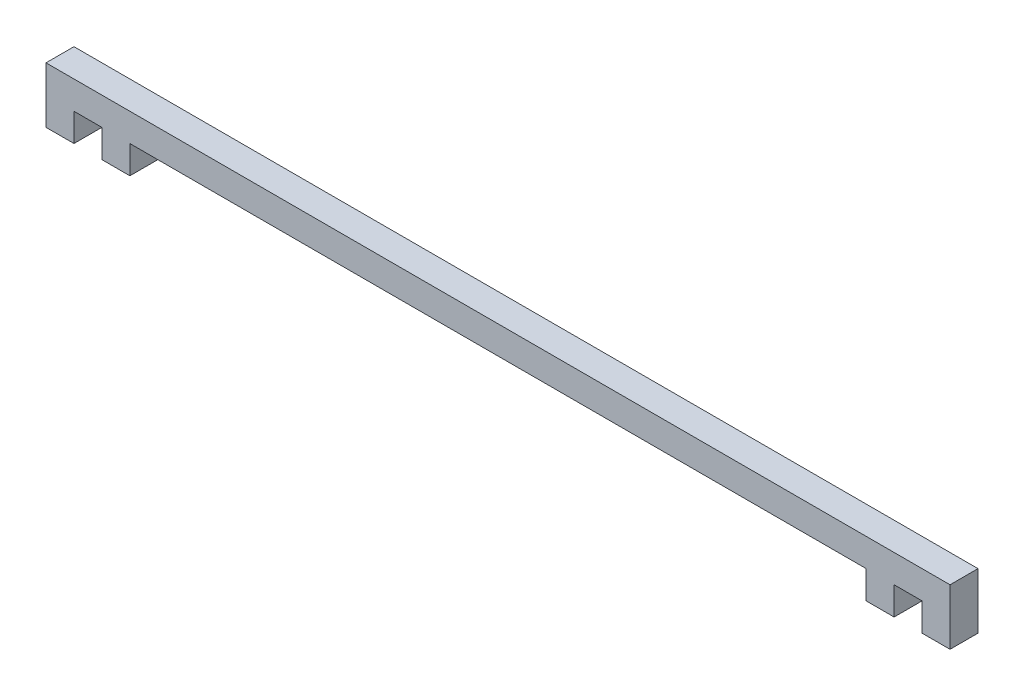
ISO-10303-21;
HEADER;
FILE_DESCRIPTION(('STEP AP214'),'2;1');
FILE_NAME('part.step','',(''),(''),'','','');
FILE_SCHEMA(('AUTOMOTIVE_DESIGN { 1 0 10303 214 1 1 1 1 }'));
ENDSEC;
DATA;
#1=APPLICATION_CONTEXT('core data for automotive mechanical design processes');
#2=APPLICATION_PROTOCOL_DEFINITION('international standard','automotive_design',2000,#1);
#3=PRODUCT_CONTEXT('',#1,'mechanical');
#4=PRODUCT('Part','Part','',(#3));
#5=PRODUCT_RELATED_PRODUCT_CATEGORY('part','',(#4));
#6=PRODUCT_DEFINITION_FORMATION('','',#4);
#7=PRODUCT_DEFINITION_CONTEXT('part definition',#1,'design');
#8=PRODUCT_DEFINITION('design','',#6,#7);
#9=PRODUCT_DEFINITION_SHAPE('','',#8);
#10=(LENGTH_UNIT() NAMED_UNIT(*) SI_UNIT(.MILLI.,.METRE.));
#11=(NAMED_UNIT(*) PLANE_ANGLE_UNIT() SI_UNIT($,.RADIAN.));
#12=(NAMED_UNIT(*) SI_UNIT($,.STERADIAN.) SOLID_ANGLE_UNIT());
#13=UNCERTAINTY_MEASURE_WITH_UNIT(LENGTH_MEASURE(1.E-05),#10,'distance_accuracy_value','');
#14=(GEOMETRIC_REPRESENTATION_CONTEXT(3) GLOBAL_UNCERTAINTY_ASSIGNED_CONTEXT((#13)) GLOBAL_UNIT_ASSIGNED_CONTEXT((#10,
#11,#12)) REPRESENTATION_CONTEXT('',''));
#15=CARTESIAN_POINT('',(0.,0.,0.));
#16=DIRECTION('',(0.,0.,1.));
#17=DIRECTION('',(1.,0.,0.));
#18=AXIS2_PLACEMENT_3D('',#15,#16,#17);
#19=CARTESIAN_POINT('',(35.5878594249201,0.,3.));
#20=DIRECTION('',(1.,0.,0.));
#21=DIRECTION('',(0.,0.,-1.));
#22=AXIS2_PLACEMENT_3D('',#19,#20,#21);
#23=PLANE('',#22);
#24=DIRECTION('',(0.,-1.,0.));
#25=VECTOR('',#24,1.);
#26=CARTESIAN_POINT('',(35.5878594249201,0.,0.));
#27=LINE('',#26,#25);
#28=CARTESIAN_POINT('',(35.5878594249201,0.,0.));
#29=VERTEX_POINT('',#28);
#30=CARTESIAN_POINT('',(35.5878594249201,-3.,0.));
#31=VERTEX_POINT('',#30);
#32=EDGE_CURVE('E188',#29,#31,#27,.T.);
#33=ORIENTED_EDGE('',*,*,#32,.T.);
#34=DIRECTION('',(0.,0.,-1.));
#35=VECTOR('',#34,1.);
#36=CARTESIAN_POINT('',(35.5878594249201,-3.,3.));
#37=LINE('',#36,#35);
#38=CARTESIAN_POINT('',(35.5878594249201,-3.,3.));
#39=VERTEX_POINT('',#38);
#40=EDGE_CURVE('E11',#39,#31,#37,.T.);
#41=ORIENTED_EDGE('',*,*,#40,.F.);
#42=DIRECTION('',(0.,-1.,0.));
#43=VECTOR('',#42,1.);
#44=CARTESIAN_POINT('',(35.5878594249201,0.,3.));
#45=LINE('',#44,#43);
#46=CARTESIAN_POINT('',(35.5878594249201,0.,3.));
#47=VERTEX_POINT('',#46);
#48=EDGE_CURVE('E234',#47,#39,#45,.T.);
#49=ORIENTED_EDGE('',*,*,#48,.F.);
#50=DIRECTION('',(0.,0.,-1.));
#51=VECTOR('',#50,1.);
#52=CARTESIAN_POINT('',(35.5878594249201,0.,3.));
#53=LINE('',#52,#51);
#54=EDGE_CURVE('E184',#47,#29,#53,.T.);
#55=ORIENTED_EDGE('',*,*,#54,.T.);
#56=EDGE_LOOP('',(#33,#41,#49,#55));
#57=FACE_BOUND('',#56,.T.);
#58=ADVANCED_FACE('F39',(#57),#23,.F.);
#59=CARTESIAN_POINT('',(35.5878594249201,-3.,3.));
#60=DIRECTION('',(0.,1.,0.));
#61=DIRECTION('',(0.,0.,1.));
#62=AXIS2_PLACEMENT_3D('',#59,#60,#61);
#63=PLANE('',#62);
#64=DIRECTION('',(1.,0.,0.));
#65=VECTOR('',#64,1.);
#66=CARTESIAN_POINT('',(35.5878594249201,-3.,0.));
#67=LINE('',#66,#65);
#68=CARTESIAN_POINT('',(38.5878594249201,-3.,0.));
#69=VERTEX_POINT('',#68);
#70=EDGE_CURVE('E192',#31,#69,#67,.T.);
#71=ORIENTED_EDGE('',*,*,#70,.T.);
#72=DIRECTION('',(0.,0.,-1.));
#73=VECTOR('',#72,1.);
#74=CARTESIAN_POINT('',(38.5878594249201,-3.,3.));
#75=LINE('',#74,#73);
#76=CARTESIAN_POINT('',(38.5878594249201,-3.,3.));
#77=VERTEX_POINT('',#76);
#78=EDGE_CURVE('E48',#77,#69,#75,.T.);
#79=ORIENTED_EDGE('',*,*,#78,.F.);
#80=DIRECTION('',(1.,0.,0.));
#81=VECTOR('',#80,1.);
#82=CARTESIAN_POINT('',(35.5878594249201,-3.,3.));
#83=LINE('',#82,#81);
#84=EDGE_CURVE('E123',#39,#77,#83,.T.);
#85=ORIENTED_EDGE('',*,*,#84,.F.);
#86=ORIENTED_EDGE('',*,*,#40,.T.);
#87=EDGE_LOOP('',(#71,#79,#85,#86));
#88=FACE_BOUND('',#87,.T.);
#89=ADVANCED_FACE('F356',(#88),#63,.F.);
#90=CARTESIAN_POINT('',(38.5878594249201,-3.,3.));
#91=DIRECTION('',(-1.,0.,0.));
#92=DIRECTION('',(0.,0.,1.));
#93=AXIS2_PLACEMENT_3D('',#90,#91,#92);
#94=PLANE('',#93);
#95=DIRECTION('',(0.,1.,0.));
#96=VECTOR('',#95,1.);
#97=CARTESIAN_POINT('',(38.5878594249201,-3.,0.));
#98=LINE('',#97,#96);
#99=CARTESIAN_POINT('',(38.5878594249201,0.,0.));
#100=VERTEX_POINT('',#99);
#101=EDGE_CURVE('E195',#69,#100,#98,.T.);
#102=ORIENTED_EDGE('',*,*,#101,.T.);
#103=DIRECTION('',(0.,0.,-1.));
#104=VECTOR('',#103,1.);
#105=CARTESIAN_POINT('',(38.5878594249201,0.,3.));
#106=LINE('',#105,#104);
#107=CARTESIAN_POINT('',(38.5878594249201,0.,3.));
#108=VERTEX_POINT('',#107);
#109=EDGE_CURVE('E277',#108,#100,#106,.T.);
#110=ORIENTED_EDGE('',*,*,#109,.F.);
#111=DIRECTION('',(0.,1.,0.));
#112=VECTOR('',#111,1.);
#113=CARTESIAN_POINT('',(38.5878594249201,-3.,3.));
#114=LINE('',#113,#112);
#115=EDGE_CURVE('E287',#77,#108,#114,.T.);
#116=ORIENTED_EDGE('',*,*,#115,.F.);
#117=ORIENTED_EDGE('',*,*,#78,.T.);
#118=EDGE_LOOP('',(#102,#110,#116,#117));
#119=FACE_BOUND('',#118,.T.);
#120=ADVANCED_FACE('F285',(#119),#94,.F.);
#121=CARTESIAN_POINT('',(38.5878594249201,0.,3.));
#122=DIRECTION('',(0.,1.,0.));
#123=DIRECTION('',(0.,0.,1.));
#124=AXIS2_PLACEMENT_3D('',#121,#122,#123);
#125=PLANE('',#124);
#126=DIRECTION('',(1.,0.,0.));
#127=VECTOR('',#126,1.);
#128=CARTESIAN_POINT('',(38.5878594249201,0.,0.));
#129=LINE('',#128,#127);
#130=CARTESIAN_POINT('',(41.5878594249201,0.,0.));
#131=VERTEX_POINT('',#130);
#132=EDGE_CURVE('E198',#100,#131,#129,.T.);
#133=ORIENTED_EDGE('',*,*,#132,.T.);
#134=DIRECTION('',(0.,0.,-1.));
#135=VECTOR('',#134,1.);
#136=CARTESIAN_POINT('',(41.5878594249201,0.,3.));
#137=LINE('',#136,#135);
#138=CARTESIAN_POINT('',(41.5878594249201,0.,3.));
#139=VERTEX_POINT('',#138);
#140=EDGE_CURVE('E273',#139,#131,#137,.T.);
#141=ORIENTED_EDGE('',*,*,#140,.F.);
#142=DIRECTION('',(1.,0.,0.));
#143=VECTOR('',#142,1.);
#144=CARTESIAN_POINT('',(38.5878594249201,0.,3.));
#145=LINE('',#144,#143);
#146=EDGE_CURVE('E306',#108,#139,#145,.T.);
#147=ORIENTED_EDGE('',*,*,#146,.F.);
#148=ORIENTED_EDGE('',*,*,#109,.T.);
#149=EDGE_LOOP('',(#133,#141,#147,#148));
#150=FACE_BOUND('',#149,.T.);
#151=ADVANCED_FACE('F296',(#150),#125,.F.);
#152=CARTESIAN_POINT('',(41.5878594249201,0.,3.));
#153=DIRECTION('',(1.,0.,0.));
#154=DIRECTION('',(0.,0.,-1.));
#155=AXIS2_PLACEMENT_3D('',#152,#153,#154);
#156=PLANE('',#155);
#157=DIRECTION('',(0.,-1.,0.));
#158=VECTOR('',#157,1.);
#159=CARTESIAN_POINT('',(41.5878594249201,0.,0.));
#160=LINE('',#159,#158);
#161=CARTESIAN_POINT('',(41.5878594249201,-3.,0.));
#162=VERTEX_POINT('',#161);
#163=EDGE_CURVE('E201',#131,#162,#160,.T.);
#164=ORIENTED_EDGE('',*,*,#163,.T.);
#165=DIRECTION('',(0.,0.,-1.));
#166=VECTOR('',#165,1.);
#167=CARTESIAN_POINT('',(41.5878594249201,-3.,3.));
#168=LINE('',#167,#166);
#169=CARTESIAN_POINT('',(41.5878594249201,-3.,3.));
#170=VERTEX_POINT('',#169);
#171=EDGE_CURVE('E269',#170,#162,#168,.T.);
#172=ORIENTED_EDGE('',*,*,#171,.F.);
#173=DIRECTION('',(0.,-1.,0.));
#174=VECTOR('',#173,1.);
#175=CARTESIAN_POINT('',(41.5878594249201,0.,3.));
#176=LINE('',#175,#174);
#177=EDGE_CURVE('E302',#139,#170,#176,.T.);
#178=ORIENTED_EDGE('',*,*,#177,.F.);
#179=ORIENTED_EDGE('',*,*,#140,.T.);
#180=EDGE_LOOP('',(#164,#172,#178,#179));
#181=FACE_BOUND('',#180,.T.);
#182=ADVANCED_FACE('F300',(#181),#156,.F.);
#183=CARTESIAN_POINT('',(41.5878594249201,-3.,3.));
#184=DIRECTION('',(0.,1.,0.));
#185=DIRECTION('',(0.,0.,1.));
#186=AXIS2_PLACEMENT_3D('',#183,#184,#185);
#187=PLANE('',#186);
#188=DIRECTION('',(1.,0.,0.));
#189=VECTOR('',#188,1.);
#190=CARTESIAN_POINT('',(41.5878594249201,-3.,0.));
#191=LINE('',#190,#189);
#192=CARTESIAN_POINT('',(44.5878594249201,-3.,0.));
#193=VERTEX_POINT('',#192);
#194=EDGE_CURVE('E204',#162,#193,#191,.T.);
#195=ORIENTED_EDGE('',*,*,#194,.T.);
#196=DIRECTION('',(0.,0.,-1.));
#197=VECTOR('',#196,1.);
#198=CARTESIAN_POINT('',(44.5878594249201,-3.,3.));
#199=LINE('',#198,#197);
#200=CARTESIAN_POINT('',(44.5878594249201,-3.,3.));
#201=VERTEX_POINT('',#200);
#202=EDGE_CURVE('E265',#201,#193,#199,.T.);
#203=ORIENTED_EDGE('',*,*,#202,.F.);
#204=DIRECTION('',(1.,0.,0.));
#205=VECTOR('',#204,1.);
#206=CARTESIAN_POINT('',(41.5878594249201,-3.,3.));
#207=LINE('',#206,#205);
#208=EDGE_CURVE('E305',#170,#201,#207,.T.);
#209=ORIENTED_EDGE('',*,*,#208,.F.);
#210=ORIENTED_EDGE('',*,*,#171,.T.);
#211=EDGE_LOOP('',(#195,#203,#209,#210));
#212=FACE_BOUND('',#211,.T.);
#213=ADVANCED_FACE('F369',(#212),#187,.F.);
#214=CARTESIAN_POINT('',(44.5878594249201,-3.,3.));
#215=DIRECTION('',(-1.,0.,0.));
#216=DIRECTION('',(0.,-1.,0.));
#217=AXIS2_PLACEMENT_3D('',#214,#215,#216);
#218=PLANE('',#217);
#219=DIRECTION('',(0.,1.,0.));
#220=VECTOR('',#219,1.);
#221=CARTESIAN_POINT('',(44.5878594249201,-3.,0.));
#222=LINE('',#221,#220);
#223=CARTESIAN_POINT('',(44.5878594249201,3.,0.));
#224=VERTEX_POINT('',#223);
#225=EDGE_CURVE('E207',#193,#224,#222,.T.);
#226=ORIENTED_EDGE('',*,*,#225,.T.);
#227=DIRECTION('',(0.,0.,-1.));
#228=VECTOR('',#227,1.);
#229=CARTESIAN_POINT('',(44.5878594249201,3.,3.));
#230=LINE('',#229,#228);
#231=CARTESIAN_POINT('',(44.5878594249201,3.,3.));
#232=VERTEX_POINT('',#231);
#233=EDGE_CURVE('E261',#232,#224,#230,.T.);
#234=ORIENTED_EDGE('',*,*,#233,.F.);
#235=DIRECTION('',(0.,1.,0.));
#236=VECTOR('',#235,1.);
#237=CARTESIAN_POINT('',(44.5878594249201,-3.,3.));
#238=LINE('',#237,#236);
#239=EDGE_CURVE('E310',#201,#232,#238,.T.);
#240=ORIENTED_EDGE('',*,*,#239,.F.);
#241=ORIENTED_EDGE('',*,*,#202,.T.);
#242=EDGE_LOOP('',(#226,#234,#240,#241));
#243=FACE_BOUND('',#242,.T.);
#244=ADVANCED_FACE('F372',(#243),#218,.F.);
#245=CARTESIAN_POINT('',(44.5878594249201,3.,3.));
#246=DIRECTION('',(0.,-1.,0.));
#247=DIRECTION('',(1.,0.,0.));
#248=AXIS2_PLACEMENT_3D('',#245,#246,#247);
#249=PLANE('',#248);
#250=DIRECTION('',(-1.,0.,0.));
#251=VECTOR('',#250,1.);
#252=CARTESIAN_POINT('',(44.5878594249201,3.,0.));
#253=LINE('',#252,#251);
#254=CARTESIAN_POINT('',(-52.4121405750799,2.99999999999999,0.));
#255=VERTEX_POINT('',#254);
#256=EDGE_CURVE('E210',#224,#255,#253,.T.);
#257=ORIENTED_EDGE('',*,*,#256,.T.);
#258=DIRECTION('',(0.,0.,-1.));
#259=VECTOR('',#258,1.);
#260=CARTESIAN_POINT('',(-52.4121405750799,2.99999999999999,3.));
#261=LINE('',#260,#259);
#262=CARTESIAN_POINT('',(-52.4121405750799,2.99999999999999,3.));
#263=VERTEX_POINT('',#262);
#264=EDGE_CURVE('E257',#263,#255,#261,.T.);
#265=ORIENTED_EDGE('',*,*,#264,.F.);
#266=DIRECTION('',(-1.,0.,0.));
#267=VECTOR('',#266,1.);
#268=CARTESIAN_POINT('',(44.5878594249201,3.,3.));
#269=LINE('',#268,#267);
#270=EDGE_CURVE('E317',#232,#263,#269,.T.);
#271=ORIENTED_EDGE('',*,*,#270,.F.);
#272=ORIENTED_EDGE('',*,*,#233,.T.);
#273=EDGE_LOOP('',(#257,#265,#271,#272));
#274=FACE_BOUND('',#273,.T.);
#275=ADVANCED_FACE('F376',(#274),#249,.F.);
#276=CARTESIAN_POINT('',(-52.4121405750799,2.99999999999999,3.));
#277=DIRECTION('',(1.,0.,0.));
#278=DIRECTION('',(0.,0.,-1.));
#279=AXIS2_PLACEMENT_3D('',#276,#277,#278);
#280=PLANE('',#279);
#281=DIRECTION('',(0.,-1.,0.));
#282=VECTOR('',#281,1.);
#283=CARTESIAN_POINT('',(-52.4121405750799,2.99999999999999,0.));
#284=LINE('',#283,#282);
#285=CARTESIAN_POINT('',(-52.4121405750799,-3.,0.));
#286=VERTEX_POINT('',#285);
#287=EDGE_CURVE('E213',#255,#286,#284,.T.);
#288=ORIENTED_EDGE('',*,*,#287,.T.);
#289=DIRECTION('',(0.,0.,-1.));
#290=VECTOR('',#289,1.);
#291=CARTESIAN_POINT('',(-52.4121405750799,-3.,3.));
#292=LINE('',#291,#290);
#293=CARTESIAN_POINT('',(-52.4121405750799,-3.,3.));
#294=VERTEX_POINT('',#293);
#295=EDGE_CURVE('E253',#294,#286,#292,.T.);
#296=ORIENTED_EDGE('',*,*,#295,.F.);
#297=DIRECTION('',(0.,-1.,0.));
#298=VECTOR('',#297,1.);
#299=CARTESIAN_POINT('',(-52.4121405750799,2.99999999999999,3.));
#300=LINE('',#299,#298);
#301=EDGE_CURVE('E320',#263,#294,#300,.T.);
#302=ORIENTED_EDGE('',*,*,#301,.F.);
#303=ORIENTED_EDGE('',*,*,#264,.T.);
#304=EDGE_LOOP('',(#288,#296,#302,#303));
#305=FACE_BOUND('',#304,.T.);
#306=ADVANCED_FACE('F380',(#305),#280,.F.);
#307=CARTESIAN_POINT('',(-52.4121405750799,-3.,3.));
#308=DIRECTION('',(0.,1.,0.));
#309=DIRECTION('',(0.,0.,1.));
#310=AXIS2_PLACEMENT_3D('',#307,#308,#309);
#311=PLANE('',#310);
#312=DIRECTION('',(1.,0.,0.));
#313=VECTOR('',#312,1.);
#314=CARTESIAN_POINT('',(-52.4121405750799,-3.,0.));
#315=LINE('',#314,#313);
#316=CARTESIAN_POINT('',(-49.4121405750799,-3.,0.));
#317=VERTEX_POINT('',#316);
#318=EDGE_CURVE('E216',#286,#317,#315,.T.);
#319=ORIENTED_EDGE('',*,*,#318,.T.);
#320=DIRECTION('',(0.,0.,-1.));
#321=VECTOR('',#320,1.);
#322=CARTESIAN_POINT('',(-49.4121405750799,-3.,3.));
#323=LINE('',#322,#321);
#324=CARTESIAN_POINT('',(-49.4121405750799,-3.,3.));
#325=VERTEX_POINT('',#324);
#326=EDGE_CURVE('E249',#325,#317,#323,.T.);
#327=ORIENTED_EDGE('',*,*,#326,.F.);
#328=DIRECTION('',(1.,0.,0.));
#329=VECTOR('',#328,1.);
#330=CARTESIAN_POINT('',(-52.4121405750799,-3.,3.));
#331=LINE('',#330,#329);
#332=EDGE_CURVE('E323',#294,#325,#331,.T.);
#333=ORIENTED_EDGE('',*,*,#332,.F.);
#334=ORIENTED_EDGE('',*,*,#295,.T.);
#335=EDGE_LOOP('',(#319,#327,#333,#334));
#336=FACE_BOUND('',#335,.T.);
#337=ADVANCED_FACE('F384',(#336),#311,.F.);
#338=CARTESIAN_POINT('',(-49.4121405750799,-3.,3.));
#339=DIRECTION('',(-1.,0.,0.));
#340=DIRECTION('',(0.,0.,1.));
#341=AXIS2_PLACEMENT_3D('',#338,#339,#340);
#342=PLANE('',#341);
#343=DIRECTION('',(0.,1.,0.));
#344=VECTOR('',#343,1.);
#345=CARTESIAN_POINT('',(-49.4121405750799,-3.,0.));
#346=LINE('',#345,#344);
#347=CARTESIAN_POINT('',(-49.4121405750799,0.,0.));
#348=VERTEX_POINT('',#347);
#349=EDGE_CURVE('E219',#317,#348,#346,.T.);
#350=ORIENTED_EDGE('',*,*,#349,.T.);
#351=DIRECTION('',(0.,0.,-1.));
#352=VECTOR('',#351,1.);
#353=CARTESIAN_POINT('',(-49.4121405750799,0.,3.));
#354=LINE('',#353,#352);
#355=CARTESIAN_POINT('',(-49.4121405750799,0.,3.));
#356=VERTEX_POINT('',#355);
#357=EDGE_CURVE('E245',#356,#348,#354,.T.);
#358=ORIENTED_EDGE('',*,*,#357,.F.);
#359=DIRECTION('',(0.,1.,0.));
#360=VECTOR('',#359,1.);
#361=CARTESIAN_POINT('',(-49.4121405750799,-3.,3.));
#362=LINE('',#361,#360);
#363=EDGE_CURVE('E326',#325,#356,#362,.T.);
#364=ORIENTED_EDGE('',*,*,#363,.F.);
#365=ORIENTED_EDGE('',*,*,#326,.T.);
#366=EDGE_LOOP('',(#350,#358,#364,#365));
#367=FACE_BOUND('',#366,.T.);
#368=ADVANCED_FACE('F388',(#367),#342,.F.);
#369=CARTESIAN_POINT('',(-49.4121405750799,0.,3.));
#370=DIRECTION('',(0.,1.,0.));
#371=DIRECTION('',(0.,0.,1.));
#372=AXIS2_PLACEMENT_3D('',#369,#370,#371);
#373=PLANE('',#372);
#374=DIRECTION('',(1.,0.,0.));
#375=VECTOR('',#374,1.);
#376=CARTESIAN_POINT('',(-49.4121405750799,0.,0.));
#377=LINE('',#376,#375);
#378=CARTESIAN_POINT('',(-46.4121405750799,0.,0.));
#379=VERTEX_POINT('',#378);
#380=EDGE_CURVE('E222',#348,#379,#377,.T.);
#381=ORIENTED_EDGE('',*,*,#380,.T.);
#382=DIRECTION('',(0.,0.,-1.));
#383=VECTOR('',#382,1.);
#384=CARTESIAN_POINT('',(-46.4121405750799,0.,3.));
#385=LINE('',#384,#383);
#386=CARTESIAN_POINT('',(-46.4121405750799,0.,3.));
#387=VERTEX_POINT('',#386);
#388=EDGE_CURVE('E241',#387,#379,#385,.T.);
#389=ORIENTED_EDGE('',*,*,#388,.F.);
#390=DIRECTION('',(1.,0.,0.));
#391=VECTOR('',#390,1.);
#392=CARTESIAN_POINT('',(-49.4121405750799,0.,3.));
#393=LINE('',#392,#391);
#394=EDGE_CURVE('E329',#356,#387,#393,.T.);
#395=ORIENTED_EDGE('',*,*,#394,.F.);
#396=ORIENTED_EDGE('',*,*,#357,.T.);
#397=EDGE_LOOP('',(#381,#389,#395,#396));
#398=FACE_BOUND('',#397,.T.);
#399=ADVANCED_FACE('F337',(#398),#373,.F.);
#400=CARTESIAN_POINT('',(-46.4121405750799,0.,3.));
#401=DIRECTION('',(1.,0.,0.));
#402=DIRECTION('',(0.,0.,-1.));
#403=AXIS2_PLACEMENT_3D('',#400,#401,#402);
#404=PLANE('',#403);
#405=DIRECTION('',(0.,-1.,0.));
#406=VECTOR('',#405,1.);
#407=CARTESIAN_POINT('',(-46.4121405750799,0.,0.));
#408=LINE('',#407,#406);
#409=CARTESIAN_POINT('',(-46.4121405750799,-3.,0.));
#410=VERTEX_POINT('',#409);
#411=EDGE_CURVE('E225',#379,#410,#408,.T.);
#412=ORIENTED_EDGE('',*,*,#411,.T.);
#413=DIRECTION('',(0.,0.,-1.));
#414=VECTOR('',#413,1.);
#415=CARTESIAN_POINT('',(-46.4121405750799,-3.,3.));
#416=LINE('',#415,#414);
#417=CARTESIAN_POINT('',(-46.4121405750799,-3.,3.));
#418=VERTEX_POINT('',#417);
#419=EDGE_CURVE('E177',#418,#410,#416,.T.);
#420=ORIENTED_EDGE('',*,*,#419,.F.);
#421=DIRECTION('',(0.,-1.,0.));
#422=VECTOR('',#421,1.);
#423=CARTESIAN_POINT('',(-46.4121405750799,0.,3.));
#424=LINE('',#423,#422);
#425=EDGE_CURVE('E166',#387,#418,#424,.T.);
#426=ORIENTED_EDGE('',*,*,#425,.F.);
#427=ORIENTED_EDGE('',*,*,#388,.T.);
#428=EDGE_LOOP('',(#412,#420,#426,#427));
#429=FACE_BOUND('',#428,.T.);
#430=ADVANCED_FACE('F341',(#429),#404,.F.);
#431=CARTESIAN_POINT('',(-46.4121405750799,-3.,3.));
#432=DIRECTION('',(0.,1.,0.));
#433=DIRECTION('',(0.,0.,1.));
#434=AXIS2_PLACEMENT_3D('',#431,#432,#433);
#435=PLANE('',#434);
#436=DIRECTION('',(1.,0.,0.));
#437=VECTOR('',#436,1.);
#438=CARTESIAN_POINT('',(-46.4121405750799,-3.,0.));
#439=LINE('',#438,#437);
#440=CARTESIAN_POINT('',(-43.4121405750799,-3.,0.));
#441=VERTEX_POINT('',#440);
#442=EDGE_CURVE('E175',#410,#441,#439,.T.);
#443=ORIENTED_EDGE('',*,*,#442,.T.);
#444=DIRECTION('',(0.,0.,-1.));
#445=VECTOR('',#444,1.);
#446=CARTESIAN_POINT('',(-43.4121405750799,-3.,3.));
#447=LINE('',#446,#445);
#448=CARTESIAN_POINT('',(-43.4121405750799,-3.,3.));
#449=VERTEX_POINT('',#448);
#450=EDGE_CURVE('E172',#449,#441,#447,.T.);
#451=ORIENTED_EDGE('',*,*,#450,.F.);
#452=DIRECTION('',(1.,0.,0.));
#453=VECTOR('',#452,1.);
#454=CARTESIAN_POINT('',(-46.4121405750799,-3.,3.));
#455=LINE('',#454,#453);
#456=EDGE_CURVE('E160',#418,#449,#455,.T.);
#457=ORIENTED_EDGE('',*,*,#456,.F.);
#458=ORIENTED_EDGE('',*,*,#419,.T.);
#459=EDGE_LOOP('',(#443,#451,#457,#458));
#460=FACE_BOUND('',#459,.T.);
#461=ADVANCED_FACE('F173',(#460),#435,.F.);
#462=CARTESIAN_POINT('',(-43.4121405750799,-3.,3.));
#463=DIRECTION('',(-1.,0.,0.));
#464=DIRECTION('',(0.,0.,1.));
#465=AXIS2_PLACEMENT_3D('',#462,#463,#464);
#466=PLANE('',#465);
#467=DIRECTION('',(0.,1.,0.));
#468=VECTOR('',#467,1.);
#469=CARTESIAN_POINT('',(-43.4121405750799,-3.,0.));
#470=LINE('',#469,#468);
#471=CARTESIAN_POINT('',(-43.4121405750799,0.,0.));
#472=VERTEX_POINT('',#471);
#473=EDGE_CURVE('E109',#441,#472,#470,.T.);
#474=ORIENTED_EDGE('',*,*,#473,.T.);
#475=DIRECTION('',(0.,0.,-1.));
#476=VECTOR('',#475,1.);
#477=CARTESIAN_POINT('',(-43.4121405750799,0.,3.));
#478=LINE('',#477,#476);
#479=CARTESIAN_POINT('',(-43.4121405750799,0.,3.));
#480=VERTEX_POINT('',#479);
#481=EDGE_CURVE('E178',#480,#472,#478,.T.);
#482=ORIENTED_EDGE('',*,*,#481,.F.);
#483=DIRECTION('',(0.,1.,0.));
#484=VECTOR('',#483,1.);
#485=CARTESIAN_POINT('',(-43.4121405750799,-3.,3.));
#486=LINE('',#485,#484);
#487=EDGE_CURVE('E164',#449,#480,#486,.T.);
#488=ORIENTED_EDGE('',*,*,#487,.F.);
#489=ORIENTED_EDGE('',*,*,#450,.T.);
#490=EDGE_LOOP('',(#474,#482,#488,#489));
#491=FACE_BOUND('',#490,.T.);
#492=ADVANCED_FACE('F180',(#491),#466,.F.);
#493=CARTESIAN_POINT('',(-43.4121405750799,0.,3.));
#494=DIRECTION('',(0.,1.,0.));
#495=DIRECTION('',(0.,0.,1.));
#496=AXIS2_PLACEMENT_3D('',#493,#494,#495);
#497=PLANE('',#496);
#498=DIRECTION('',(1.,0.,0.));
#499=VECTOR('',#498,1.);
#500=CARTESIAN_POINT('',(-43.4121405750799,0.,0.));
#501=LINE('',#500,#499);
#502=EDGE_CURVE('E115',#472,#29,#501,.T.);
#503=ORIENTED_EDGE('',*,*,#502,.T.);
#504=ORIENTED_EDGE('',*,*,#54,.F.);
#505=DIRECTION('',(1.,0.,0.));
#506=VECTOR('',#505,1.);
#507=CARTESIAN_POINT('',(-43.4121405750799,0.,3.));
#508=LINE('',#507,#506);
#509=EDGE_CURVE('E56',#480,#47,#508,.T.);
#510=ORIENTED_EDGE('',*,*,#509,.F.);
#511=ORIENTED_EDGE('',*,*,#481,.T.);
#512=EDGE_LOOP('',(#503,#504,#510,#511));
#513=FACE_BOUND('',#512,.T.);
#514=ADVANCED_FACE('F345',(#513),#497,.F.);
#515=CARTESIAN_POINT('',(0.,0.,3.));
#516=DIRECTION('',(0.,0.,1.));
#517=DIRECTION('',(1.,0.,0.));
#518=AXIS2_PLACEMENT_3D('',#515,#516,#517);
#519=PLANE('',#518);
#520=ORIENTED_EDGE('',*,*,#48,.T.);
#521=ORIENTED_EDGE('',*,*,#84,.T.);
#522=ORIENTED_EDGE('',*,*,#115,.T.);
#523=ORIENTED_EDGE('',*,*,#146,.T.);
#524=ORIENTED_EDGE('',*,*,#177,.T.);
#525=ORIENTED_EDGE('',*,*,#208,.T.);
#526=ORIENTED_EDGE('',*,*,#239,.T.);
#527=ORIENTED_EDGE('',*,*,#270,.T.);
#528=ORIENTED_EDGE('',*,*,#301,.T.);
#529=ORIENTED_EDGE('',*,*,#332,.T.);
#530=ORIENTED_EDGE('',*,*,#363,.T.);
#531=ORIENTED_EDGE('',*,*,#394,.T.);
#532=ORIENTED_EDGE('',*,*,#425,.T.);
#533=ORIENTED_EDGE('',*,*,#456,.T.);
#534=ORIENTED_EDGE('',*,*,#487,.T.);
#535=ORIENTED_EDGE('',*,*,#509,.T.);
#536=EDGE_LOOP('',(#520,#521,#522,#523,#524,#525,#526,#527,#528,#529,#530,#531,#532,#533,#534,#535));
#537=FACE_BOUND('',#536,.T.);
#538=ADVANCED_FACE('F162',(#537),#519,.T.);
#539=CARTESIAN_POINT('',(0.,0.,0.));
#540=DIRECTION('',(0.,0.,1.));
#541=DIRECTION('',(1.,0.,0.));
#542=AXIS2_PLACEMENT_3D('',#539,#540,#541);
#543=PLANE('',#542);
#544=ORIENTED_EDGE('',*,*,#32,.F.);
#545=ORIENTED_EDGE('',*,*,#502,.F.);
#546=ORIENTED_EDGE('',*,*,#473,.F.);
#547=ORIENTED_EDGE('',*,*,#442,.F.);
#548=ORIENTED_EDGE('',*,*,#411,.F.);
#549=ORIENTED_EDGE('',*,*,#380,.F.);
#550=ORIENTED_EDGE('',*,*,#349,.F.);
#551=ORIENTED_EDGE('',*,*,#318,.F.);
#552=ORIENTED_EDGE('',*,*,#287,.F.);
#553=ORIENTED_EDGE('',*,*,#256,.F.);
#554=ORIENTED_EDGE('',*,*,#225,.F.);
#555=ORIENTED_EDGE('',*,*,#194,.F.);
#556=ORIENTED_EDGE('',*,*,#163,.F.);
#557=ORIENTED_EDGE('',*,*,#132,.F.);
#558=ORIENTED_EDGE('',*,*,#101,.F.);
#559=ORIENTED_EDGE('',*,*,#70,.F.);
#560=EDGE_LOOP('',(#544,#545,#546,#547,#548,#549,#550,#551,#552,#553,#554,#555,#556,#557,#558,#559));
#561=FACE_BOUND('',#560,.T.);
#562=ADVANCED_FACE('F291',(#561),#543,.F.);
#563=CLOSED_SHELL('',(#58,#89,#120,#151,#182,#213,#244,#275,#306,#337,#368,#399,#430,#461,#492,
#514,#538,#562));
#564=MANIFOLD_SOLID_BREP('B2',#563);
#565=ADVANCED_BREP_SHAPE_REPRESENTATION('',(#18,#564),#14);
#566=SHAPE_DEFINITION_REPRESENTATION(#9,#565);
ENDSEC;
END-ISO-10303-21;
